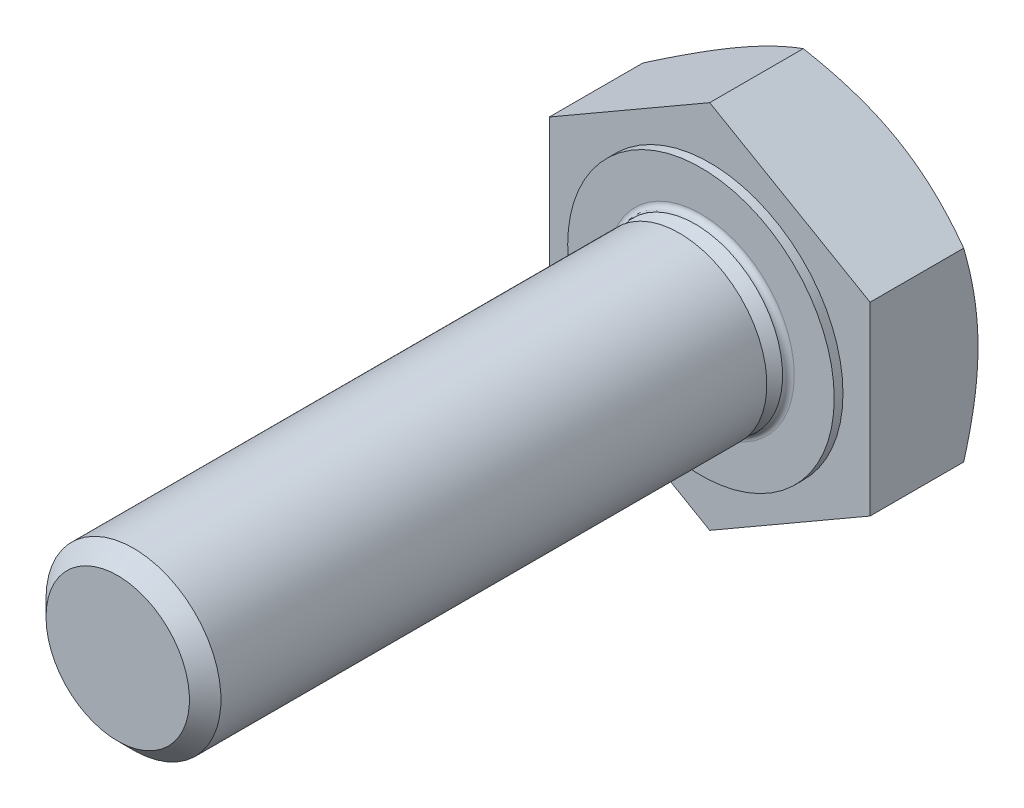
ISO-10303-21;
HEADER;
FILE_DESCRIPTION(('STEP AP214'),'2;1');
FILE_NAME('part.step','',(''),(''),'','','');
FILE_SCHEMA(('AUTOMOTIVE_DESIGN { 1 0 10303 214 1 1 1 1 }'));
ENDSEC;
DATA;
#1=APPLICATION_CONTEXT('core data for automotive mechanical design processes');
#2=APPLICATION_PROTOCOL_DEFINITION('international standard','automotive_design',2000,#1);
#3=PRODUCT_CONTEXT('',#1,'mechanical');
#4=PRODUCT('Part','Part','',(#3));
#5=PRODUCT_RELATED_PRODUCT_CATEGORY('part','',(#4));
#6=PRODUCT_DEFINITION_FORMATION('','',#4);
#7=PRODUCT_DEFINITION_CONTEXT('part definition',#1,'design');
#8=PRODUCT_DEFINITION('design','',#6,#7);
#9=PRODUCT_DEFINITION_SHAPE('','',#8);
#10=(LENGTH_UNIT() NAMED_UNIT(*) SI_UNIT(.MILLI.,.METRE.));
#11=(NAMED_UNIT(*) PLANE_ANGLE_UNIT() SI_UNIT($,.RADIAN.));
#12=(NAMED_UNIT(*) SI_UNIT($,.STERADIAN.) SOLID_ANGLE_UNIT());
#13=UNCERTAINTY_MEASURE_WITH_UNIT(LENGTH_MEASURE(1.E-05),#10,'distance_accuracy_value','');
#14=(GEOMETRIC_REPRESENTATION_CONTEXT(3) GLOBAL_UNCERTAINTY_ASSIGNED_CONTEXT((#13)) GLOBAL_UNIT_ASSIGNED_CONTEXT((#10,
#11,#12)) REPRESENTATION_CONTEXT('',''));
#15=CARTESIAN_POINT('',(0.,0.,0.));
#16=DIRECTION('',(0.,0.,1.));
#17=DIRECTION('',(1.,0.,0.));
#18=AXIS2_PLACEMENT_3D('',#15,#16,#17);
#19=CARTESIAN_POINT('',(0.,0.,10.));
#20=DIRECTION('',(0.,0.,-1.));
#21=DIRECTION('',(-1.,0.,0.));
#22=AXIS2_PLACEMENT_3D('',#19,#20,#21);
#23=PLANE('',#22);
#24=CARTESIAN_POINT('',(0.,0.,10.));
#25=DIRECTION('',(0.,0.,-1.));
#26=DIRECTION('',(-1.,0.,0.));
#27=AXIS2_PLACEMENT_3D('',#24,#25,#26);
#28=CIRCLE('',#27,1.229375);
#29=CARTESIAN_POINT('',(-1.229375,0.,10.));
#30=VERTEX_POINT('',#29);
#31=EDGE_CURVE('E11',#30,#30,#28,.T.);
#32=ORIENTED_EDGE('',*,*,#31,.F.);
#33=EDGE_LOOP('',(#32));
#34=FACE_BOUND('',#33,.T.);
#35=ADVANCED_FACE('F16',(#34),#23,.F.);
#36=CARTESIAN_POINT('',(0.,0.,10.));
#37=DIRECTION('',(0.,0.,-1.));
#38=DIRECTION('',(-1.,0.,0.));
#39=AXIS2_PLACEMENT_3D('',#36,#37,#38);
#40=CONICAL_SURFACE('',#39,1.229375,0.785398163397445);
#41=CARTESIAN_POINT('',(0.,0.,9.729375));
#42=DIRECTION('',(0.,0.,-1.));
#43=DIRECTION('',(-1.,0.,0.));
#44=AXIS2_PLACEMENT_3D('',#41,#42,#43);
#45=CIRCLE('',#44,1.5);
#46=CARTESIAN_POINT('',(-1.5,0.,9.729375));
#47=VERTEX_POINT('',#46);
#48=EDGE_CURVE('E25',#47,#47,#45,.T.);
#49=ORIENTED_EDGE('',*,*,#48,.F.);
#50=EDGE_LOOP('',(#49));
#51=FACE_BOUND('',#50,.T.);
#52=ORIENTED_EDGE('',*,*,#31,.T.);
#53=EDGE_LOOP('',(#52));
#54=FACE_BOUND('',#53,.T.);
#55=ADVANCED_FACE('F208',(#51,#54),#40,.T.);
#56=CARTESIAN_POINT('',(0.,0.,-0.65));
#57=DIRECTION('',(0.,0.,-1.));
#58=DIRECTION('',(-1.,0.,0.));
#59=AXIS2_PLACEMENT_3D('',#56,#57,#58);
#60=CYLINDRICAL_SURFACE('',#59,1.5);
#61=CARTESIAN_POINT('',(0.,0.,0.370625));
#62=DIRECTION('',(0.,0.,-1.));
#63=DIRECTION('',(-1.,0.,0.));
#64=AXIS2_PLACEMENT_3D('',#61,#62,#63);
#65=CIRCLE('',#64,1.5);
#66=CARTESIAN_POINT('',(-1.5,0.,0.370625));
#67=VERTEX_POINT('',#66);
#68=EDGE_CURVE('E223',#67,#67,#65,.T.);
#69=ORIENTED_EDGE('',*,*,#68,.F.);
#70=EDGE_LOOP('',(#69));
#71=FACE_BOUND('',#70,.T.);
#72=ORIENTED_EDGE('',*,*,#48,.T.);
#73=EDGE_LOOP('',(#72));
#74=FACE_BOUND('',#73,.T.);
#75=ADVANCED_FACE('F205',(#71,#74),#60,.T.);
#76=CARTESIAN_POINT('',(0.,1.5,0.370625));
#77=DIRECTION('',(0.,0.,1.));
#78=DIRECTION('',(1.,0.,0.));
#79=AXIS2_PLACEMENT_3D('',#76,#77,#78);
#80=PLANE('',#79);
#81=CARTESIAN_POINT('',(0.,0.,0.370625));
#82=DIRECTION('',(0.,0.,-1.));
#83=DIRECTION('',(-1.,0.,0.));
#84=AXIS2_PLACEMENT_3D('',#81,#82,#83);
#85=CIRCLE('',#84,1.229375);
#86=CARTESIAN_POINT('',(-1.229375,0.,0.370625));
#87=VERTEX_POINT('',#86);
#88=EDGE_CURVE('E230',#87,#87,#85,.T.);
#89=ORIENTED_EDGE('',*,*,#88,.F.);
#90=EDGE_LOOP('',(#89));
#91=FACE_BOUND('',#90,.T.);
#92=ORIENTED_EDGE('',*,*,#68,.T.);
#93=EDGE_LOOP('',(#92));
#94=FACE_BOUND('',#93,.T.);
#95=ADVANCED_FACE('F201',(#91,#94),#80,.F.);
#96=CARTESIAN_POINT('',(0.,0.,0.370625));
#97=DIRECTION('',(0.,0.,-1.));
#98=DIRECTION('',(-1.,0.,0.));
#99=AXIS2_PLACEMENT_3D('',#96,#97,#98);
#100=CONICAL_SURFACE('',#99,1.229375,0.785398163397449);
#101=CARTESIAN_POINT('',(0.,0.,0.1));
#102=DIRECTION('',(0.,0.,-1.));
#103=DIRECTION('',(-1.,0.,0.));
#104=AXIS2_PLACEMENT_3D('',#101,#102,#103);
#105=CIRCLE('',#104,1.5);
#106=CARTESIAN_POINT('',(-1.5,0.,0.1));
#107=VERTEX_POINT('',#106);
#108=EDGE_CURVE('E236',#107,#107,#105,.T.);
#109=ORIENTED_EDGE('',*,*,#108,.F.);
#110=EDGE_LOOP('',(#109));
#111=FACE_BOUND('',#110,.T.);
#112=ORIENTED_EDGE('',*,*,#88,.T.);
#113=EDGE_LOOP('',(#112));
#114=FACE_BOUND('',#113,.T.);
#115=ADVANCED_FACE('F197',(#111,#114),#100,.T.);
#116=CARTESIAN_POINT('',(0.,0.,0.1));
#117=DIRECTION('',(0.,0.,-1.));
#118=DIRECTION('',(-1.,0.,0.));
#119=AXIS2_PLACEMENT_3D('',#116,#117,#118);
#120=TOROIDAL_SURFACE('',#119,1.6,0.1);
#121=ORIENTED_EDGE('',*,*,#108,.T.);
#122=EDGE_LOOP('',(#121));
#123=FACE_BOUND('',#122,.T.);
#124=CARTESIAN_POINT('',(0.,0.,0.));
#125=DIRECTION('',(0.,0.,-1.));
#126=DIRECTION('',(-1.,0.,0.));
#127=AXIS2_PLACEMENT_3D('',#124,#125,#126);
#128=CIRCLE('',#127,1.6);
#129=CARTESIAN_POINT('',(-1.6,0.,0.));
#130=VERTEX_POINT('',#129);
#131=EDGE_CURVE('E240',#130,#130,#128,.T.);
#132=ORIENTED_EDGE('',*,*,#131,.F.);
#133=EDGE_LOOP('',(#132));
#134=FACE_BOUND('',#133,.T.);
#135=ADVANCED_FACE('F193',(#123,#134),#120,.F.);
#136=CARTESIAN_POINT('',(0.,1.6,0.));
#137=DIRECTION('',(0.,0.,-1.));
#138=DIRECTION('',(-1.,0.,0.));
#139=AXIS2_PLACEMENT_3D('',#136,#137,#138);
#140=PLANE('',#139);
#141=CARTESIAN_POINT('',(0.,0.,0.));
#142=DIRECTION('',(0.,0.,-1.));
#143=DIRECTION('',(-1.,0.,0.));
#144=AXIS2_PLACEMENT_3D('',#141,#142,#143);
#145=CIRCLE('',#144,2.285);
#146=CARTESIAN_POINT('',(-2.285,0.,0.));
#147=VERTEX_POINT('',#146);
#148=EDGE_CURVE('E243',#147,#147,#145,.T.);
#149=ORIENTED_EDGE('',*,*,#148,.F.);
#150=EDGE_LOOP('',(#149));
#151=FACE_BOUND('',#150,.T.);
#152=ORIENTED_EDGE('',*,*,#131,.T.);
#153=EDGE_LOOP('',(#152));
#154=FACE_BOUND('',#153,.T.);
#155=ADVANCED_FACE('F189',(#151,#154),#140,.F.);
#156=CARTESIAN_POINT('',(0.,0.,-0.65));
#157=DIRECTION('',(0.,0.,-1.));
#158=DIRECTION('',(-1.,0.,0.));
#159=AXIS2_PLACEMENT_3D('',#156,#157,#158);
#160=CYLINDRICAL_SURFACE('',#159,2.285);
#161=CARTESIAN_POINT('',(0.,0.,-0.15));
#162=DIRECTION('',(0.,0.,1.));
#163=DIRECTION('',(1.,0.,0.));
#164=AXIS2_PLACEMENT_3D('',#161,#162,#163);
#165=CIRCLE('',#164,2.285);
#166=CARTESIAN_POINT('',(2.285,0.,-0.15));
#167=VERTEX_POINT('',#166);
#168=EDGE_CURVE('E19',#167,#167,#165,.T.);
#169=ORIENTED_EDGE('',*,*,#168,.T.);
#170=EDGE_LOOP('',(#169));
#171=FACE_BOUND('',#170,.T.);
#172=ORIENTED_EDGE('',*,*,#148,.T.);
#173=EDGE_LOOP('',(#172));
#174=FACE_BOUND('',#173,.T.);
#175=ADVANCED_FACE('F186',(#171,#174),#160,.T.);
#176=CARTESIAN_POINT('',(0.,0.,-0.15));
#177=DIRECTION('',(0.,0.,1.));
#178=DIRECTION('',(-1.,0.,0.));
#179=AXIS2_PLACEMENT_3D('',#176,#177,#178);
#180=PLANE('',#179);
#181=DIRECTION('',(0.866025403784439,-0.5,0.));
#182=VECTOR('',#181,1.);
#183=CARTESIAN_POINT('',(0.,-3.17542648054294,-0.15));
#184=LINE('',#183,#182);
#185=CARTESIAN_POINT('',(-2.75,-1.58771324027147,-0.15));
#186=VERTEX_POINT('',#185);
#187=CARTESIAN_POINT('',(0.,-3.17542648054294,-0.15));
#188=VERTEX_POINT('',#187);
#189=EDGE_CURVE('E267',#186,#188,#184,.T.);
#190=ORIENTED_EDGE('',*,*,#189,.T.);
#191=DIRECTION('',(0.866025403784438,0.5,0.));
#192=VECTOR('',#191,1.);
#193=CARTESIAN_POINT('',(2.75,-1.58771324027147,-0.15));
#194=LINE('',#193,#192);
#195=CARTESIAN_POINT('',(2.75,-1.58771324027147,-0.15));
#196=VERTEX_POINT('',#195);
#197=EDGE_CURVE('E100',#188,#196,#194,.T.);
#198=ORIENTED_EDGE('',*,*,#197,.T.);
#199=DIRECTION('',(0.,1.,0.));
#200=VECTOR('',#199,1.);
#201=CARTESIAN_POINT('',(2.75,1.58771324027147,-0.15));
#202=LINE('',#201,#200);
#203=CARTESIAN_POINT('',(2.75,1.58771324027147,-0.15));
#204=VERTEX_POINT('',#203);
#205=EDGE_CURVE('E96',#196,#204,#202,.T.);
#206=ORIENTED_EDGE('',*,*,#205,.T.);
#207=DIRECTION('',(-0.866025403784439,0.5,0.));
#208=VECTOR('',#207,1.);
#209=CARTESIAN_POINT('',(0.,3.17542648054294,-0.15));
#210=LINE('',#209,#208);
#211=CARTESIAN_POINT('',(0.,3.17542648054294,-0.15));
#212=VERTEX_POINT('',#211);
#213=EDGE_CURVE('E108',#204,#212,#210,.T.);
#214=ORIENTED_EDGE('',*,*,#213,.T.);
#215=DIRECTION('',(-0.866025403784439,-0.5,0.));
#216=VECTOR('',#215,1.);
#217=CARTESIAN_POINT('',(-2.75,1.58771324027147,-0.15));
#218=LINE('',#217,#216);
#219=CARTESIAN_POINT('',(-2.75,1.58771324027147,-0.15));
#220=VERTEX_POINT('',#219);
#221=EDGE_CURVE('E292',#212,#220,#218,.T.);
#222=ORIENTED_EDGE('',*,*,#221,.T.);
#223=DIRECTION('',(0.,-1.,0.));
#224=VECTOR('',#223,1.);
#225=CARTESIAN_POINT('',(-2.75,-1.58771324027147,-0.15));
#226=LINE('',#225,#224);
#227=EDGE_CURVE('E271',#220,#186,#226,.T.);
#228=ORIENTED_EDGE('',*,*,#227,.T.);
#229=EDGE_LOOP('',(#190,#198,#206,#214,#222,#228));
#230=FACE_BOUND('',#229,.T.);
#231=ORIENTED_EDGE('',*,*,#168,.F.);
#232=EDGE_LOOP('',(#231));
#233=FACE_BOUND('',#232,.T.);
#234=ADVANCED_FACE('F141',(#230,#233),#180,.T.);
#235=CARTESIAN_POINT('',(0.,0.,-1.75390444775793));
#236=DIRECTION('',(0.,0.,1.));
#237=DIRECTION('',(-1.,0.,0.));
#238=AXIS2_PLACEMENT_3D('',#235,#236,#237);
#239=CONICAL_SURFACE('',#238,3.17625,1.0471975511966);
#240=CARTESIAN_POINT('',(0.,0.,-2.));
#241=DIRECTION('',(0.,0.,1.));
#242=DIRECTION('',(-1.,0.,0.));
#243=AXIS2_PLACEMENT_3D('',#240,#241,#242);
#244=CIRCLE('',#243,2.75);
#245=CARTESIAN_POINT('',(-1.375,-2.38156986040721,-2.));
#246=VERTEX_POINT('',#245);
#247=CARTESIAN_POINT('',(1.375,-2.38156986040721,-2.));
#248=VERTEX_POINT('',#247);
#249=EDGE_CURVE('E314',#246,#248,#244,.T.);
#250=ORIENTED_EDGE('',*,*,#249,.T.);
#251=CARTESIAN_POINT('',(2.750002,-1.58771208557093,-1.75437924027111));
#252=CARTESIAN_POINT('',(2.62915612085022,-1.65748248642851,-1.79467292047909));
#253=CARTESIAN_POINT('',(2.50726710186514,-1.72785514435081,-1.83131792217716));
#254=CARTESIAN_POINT('',(2.26137863431359,-1.86981891728232,-1.89528069122831));
#255=CARTESIAN_POINT('',(2.13737481818672,-1.94141255390371,-1.92257583341488));
#256=CARTESIAN_POINT('',(1.89090390407776,-2.08371260251193,-1.96506271633853));
#257=CARTESIAN_POINT('',(1.76847471831933,-2.15439712586623,-1.98053726335408));
#258=CARTESIAN_POINT('',(1.52304057361299,-2.29609859538076,-1.99900723381397));
#259=CARTESIAN_POINT('',(1.40003650614739,-2.36711502684345,-2.00201795561212));
#260=CARTESIAN_POINT('',(1.17021633803182,-2.49980176277017,-1.99573883896288));
#261=CARTESIAN_POINT('',(1.06336575208685,-2.56149197732857,-1.9879907318379));
#262=CARTESIAN_POINT('',(0.850360677359033,-2.68447051456143,-1.96343868045749));
#263=CARTESIAN_POINT('',(0.744206924761406,-2.74575841219916,-1.94662635736892));
#264=CARTESIAN_POINT('',(0.530763034689776,-2.8689902995889,-1.90459877801697));
#265=CARTESIAN_POINT('',(0.423499897978887,-2.93091870044305,-1.87920545160062));
#266=CARTESIAN_POINT('',(0.210572997292227,-3.05385210387221,-1.82157332618879));
#267=CARTESIAN_POINT('',(0.104906507552426,-3.11485868016781,-1.78934805987542));
#268=CARTESIAN_POINT('',(-1.99999999931377E-06,-3.17542763524348,-1.75437924027111));
#269=B_SPLINE_CURVE_WITH_KNOTS('',3,(#251,#252,#253,#254,#255,#256,#257,#258,#259,#260,#261,
#262,#263,#264,#265,#266,#267,#268),.UNSPECIFIED.,.F.,.F.,(4,2,2,2,2,2,2,2,4),(0.,
0.435897174011014,0.872841818983068,1.29897342204202,1.72458182710171,2.0950998279895,
2.46596091919292,2.84504596377344,3.22338701890322),.UNSPECIFIED.);
#270=CARTESIAN_POINT('',(0.,-3.17542648054294,-1.75437990693814));
#271=VERTEX_POINT('',#270);
#272=EDGE_CURVE('E32',#248,#271,#269,.T.);
#273=ORIENTED_EDGE('',*,*,#272,.T.);
#274=CARTESIAN_POINT('',(2.00000000032905E-06,-3.17542763524348,-1.75437924027111));
#275=CARTESIAN_POINT('',(-0.120843879149776,-3.1056572343859,-1.79467292047909));
#276=CARTESIAN_POINT('',(-0.242732898134861,-3.0352845764636,-1.83131792217716));
#277=CARTESIAN_POINT('',(-0.488621365686414,-2.89332080353209,-1.89528069122831));
#278=CARTESIAN_POINT('',(-0.612625181813276,-2.8217271669107,-1.92257583341489));
#279=CARTESIAN_POINT('',(-0.859096095922239,-2.67942711830248,-1.96506271633853));
#280=CARTESIAN_POINT('',(-0.98152528168067,-2.60874259494818,-1.98053726335408));
#281=CARTESIAN_POINT('',(-1.22695942638702,-2.46704112543365,-1.99900723381397));
#282=CARTESIAN_POINT('',(-1.34996349385262,-2.39602469397096,-2.00201795561212));
#283=CARTESIAN_POINT('',(-1.57978366196818,-2.26333795804424,-1.99573883896288));
#284=CARTESIAN_POINT('',(-1.68663424791315,-2.20164774348584,-1.9879907318379));
#285=CARTESIAN_POINT('',(-1.89963932264097,-2.07866920625298,-1.96343868045749));
#286=CARTESIAN_POINT('',(-2.0057930752386,-2.01738130861525,-1.94662635736892));
#287=CARTESIAN_POINT('',(-2.21923696531022,-1.89414942122551,-1.90459877801697));
#288=CARTESIAN_POINT('',(-2.32650010202111,-1.83222102037136,-1.87920545160062));
#289=CARTESIAN_POINT('',(-2.53942700270777,-1.7092876169422,-1.82157332618879));
#290=CARTESIAN_POINT('',(-2.64509349244757,-1.64828104064661,-1.78934805987542));
#291=CARTESIAN_POINT('',(-2.750002,-1.58771208557094,-1.75437924027111));
#292=B_SPLINE_CURVE_WITH_KNOTS('',3,(#274,#275,#276,#277,#278,#279,#280,#281,#282,#283,#284,
#285,#286,#287,#288,#289,#290,#291),.UNSPECIFIED.,.F.,.F.,(4,2,2,2,2,2,2,2,4),(0.,
0.435897174011015,0.87284181898307,1.29897342204202,1.72458182710171,2.0950998279895,
2.46596091919292,2.84504596377344,3.22338701890322),.UNSPECIFIED.);
#293=EDGE_CURVE('E171',#271,#246,#292,.T.);
#294=ORIENTED_EDGE('',*,*,#293,.T.);
#295=EDGE_LOOP('',(#250,#273,#294));
#296=FACE_BOUND('',#295,.T.);
#297=ADVANCED_FACE('F139',(#296),#239,.T.);
#298=CARTESIAN_POINT('',(2.75,0.,-2.));
#299=VERTEX_POINT('',#298);
#300=CARTESIAN_POINT('',(1.375,2.38156986040721,-2.));
#301=VERTEX_POINT('',#300);
#302=EDGE_CURVE('E332',#299,#301,#244,.T.);
#303=ORIENTED_EDGE('',*,*,#302,.T.);
#304=CARTESIAN_POINT('',(-2.00000000052029E-06,3.17542763524348,-1.7543792402711));
#305=CARTESIAN_POINT('',(0.120843879149775,3.1056572343859,-1.79467292047909));
#306=CARTESIAN_POINT('',(0.242732898134861,3.0352845764636,-1.83131792217716));
#307=CARTESIAN_POINT('',(0.488621365686414,2.89332080353209,-1.89528069122831));
#308=CARTESIAN_POINT('',(0.612625181813275,2.8217271669107,-1.92257583341489));
#309=CARTESIAN_POINT('',(0.859096095922239,2.67942711830248,-1.96506271633853));
#310=CARTESIAN_POINT('',(0.98152528168067,2.60874259494818,-1.98053726335408));
#311=CARTESIAN_POINT('',(1.22695942638702,2.46704112543365,-1.99900723381397));
#312=CARTESIAN_POINT('',(1.34996349385262,2.39602469397096,-2.00201795561212));
#313=CARTESIAN_POINT('',(1.57978366196818,2.26333795804424,-1.99573883896288));
#314=CARTESIAN_POINT('',(1.68663424791315,2.20164774348584,-1.9879907318379));
#315=CARTESIAN_POINT('',(1.89963932264097,2.07866920625298,-1.96343868045749));
#316=CARTESIAN_POINT('',(2.0057930752386,2.01738130861525,-1.94662635736892));
#317=CARTESIAN_POINT('',(2.21923696531022,1.89414942122551,-1.90459877801697));
#318=CARTESIAN_POINT('',(2.32650010202111,1.83222102037136,-1.87920545160062));
#319=CARTESIAN_POINT('',(2.53942700270777,1.7092876169422,-1.82157332618879));
#320=CARTESIAN_POINT('',(2.64509349244757,1.64828104064661,-1.78934805987542));
#321=CARTESIAN_POINT('',(2.750002,1.58771208557094,-1.75437924027111));
#322=B_SPLINE_CURVE_WITH_KNOTS('',3,(#304,#305,#306,#307,#308,#309,#310,#311,#312,#313,#314,
#315,#316,#317,#318,#319,#320,#321),.UNSPECIFIED.,.F.,.F.,(4,2,2,2,2,2,2,2,4),(0.,
0.435897174011015,0.872841818983071,1.29897342204202,1.72458182710172,2.0950998279895,
2.46596091919292,2.84504596377344,3.22338701890322),.UNSPECIFIED.);
#323=CARTESIAN_POINT('',(2.75,1.58771324027147,-1.75437990693814));
#324=VERTEX_POINT('',#323);
#325=EDGE_CURVE('E147',#301,#324,#322,.T.);
#326=ORIENTED_EDGE('',*,*,#325,.T.);
#327=CARTESIAN_POINT('',(2.75,4.21091544038396,-0.684019681711729));
#328=CARTESIAN_POINT('',(2.75,4.09017437588851,-0.742368707183688));
#329=CARTESIAN_POINT('',(2.75,3.96914784711614,-0.800137715262762));
#330=CARTESIAN_POINT('',(2.75,3.72636951096205,-0.91418425621132));
#331=CARTESIAN_POINT('',(2.75,3.6046175824246,-0.97046153086399));
#332=CARTESIAN_POINT('',(2.75,3.35957643515293,-1.08148962191275));
#333=CARTESIAN_POINT('',(2.75,3.23628240631407,-1.13622986065184));
#334=CARTESIAN_POINT('',(2.75,2.98868100437406,-1.24335920729038));
#335=CARTESIAN_POINT('',(2.75,2.86437368449152,-1.29574843773788));
#336=CARTESIAN_POINT('',(2.75,2.61300450954009,-1.39817269250286));
#337=CARTESIAN_POINT('',(2.75,2.48592757393808,-1.44817090922629));
#338=CARTESIAN_POINT('',(2.75,2.23027484276222,-1.54425165729229));
#339=CARTESIAN_POINT('',(2.75,2.10169888223727,-1.59033375299501));
#340=CARTESIAN_POINT('',(2.75,1.84310760285608,-1.67734409392986));
#341=CARTESIAN_POINT('',(2.75,1.71309600867851,-1.71828329565219));
#342=CARTESIAN_POINT('',(2.75,1.45122453211976,-1.79367831866066));
#343=CARTESIAN_POINT('',(2.75,1.3193652484388,-1.82813619015518));
#344=CARTESIAN_POINT('',(2.75,1.05370835973643,-1.8888957515256));
#345=CARTESIAN_POINT('',(2.75,0.919910249320777,-1.91519527322314));
#346=CARTESIAN_POINT('',(2.75,0.650700809036252,-1.95786745335482));
#347=CARTESIAN_POINT('',(2.75,0.515289477753012,-1.97424010308503));
#348=CARTESIAN_POINT('',(2.75,0.244419787628747,-1.99561013382522));
#349=CARTESIAN_POINT('',(2.75,0.108967258717275,-2.00067953612215));
#350=CARTESIAN_POINT('',(2.75,-0.161843059976616,-1.99917372347299));
#351=CARTESIAN_POINT('',(2.75,-0.297200865225811,-1.99260153157476));
#352=CARTESIAN_POINT('',(2.75,-0.528341855784543,-1.97190059644488));
#353=CARTESIAN_POINT('',(2.75,-0.624380039942034,-1.96046809753876));
#354=CARTESIAN_POINT('',(2.75,-0.815714586504112,-1.93248611681532));
#355=CARTESIAN_POINT('',(2.75,-0.911010829492239,-1.91593582805087));
#356=CARTESIAN_POINT('',(2.75,-1.19570893930552,-1.8594768667663));
#357=CARTESIAN_POINT('',(2.75,-1.38377638238591,-1.81277463442329));
#358=CARTESIAN_POINT('',(2.75,-1.66519083702709,-1.73222534427907));
#359=CARTESIAN_POINT('',(2.75,-1.76000470576513,-1.70321560843497));
#360=CARTESIAN_POINT('',(2.75,-1.94864284283357,-1.64232546778638));
#361=CARTESIAN_POINT('',(2.75,-2.0424677445283,-1.61044704292464));
#362=CARTESIAN_POINT('',(2.75,-2.22873560264422,-1.54448286971691));
#363=CARTESIAN_POINT('',(2.75,-2.32118336499496,-1.51041055539404));
#364=CARTESIAN_POINT('',(2.75,-2.5053616066891,-1.44026597621142));
#365=CARTESIAN_POINT('',(2.75,-2.59709177881638,-1.40419290309535));
#366=CARTESIAN_POINT('',(2.75,-2.68849026920457,-1.36731688469231));
#367=B_SPLINE_CURVE_WITH_KNOTS('',3,(#327,#328,#329,#330,#331,#332,#333,#334,#335,#336,#337,
#338,#339,#340,#341,#342,#343,#344,#345,#346,#347,#348,#349,#350,#351,#352,#353,#354,#355,#356,
#357,#358,#359,#360,#361,#362,#363,#364,#365,#366),.UNSPECIFIED.,.F.,.F.,(4,2,2,2,2,2,2,2,2,2,2,
2,2,2,2,2,2,2,2,4),(0.,0.402307675579641,0.80468454116917,1.20936393187761,1.61402220381253,
2.02364942710366,2.43332215894505,2.84210675846266,3.25076183082298,3.65952541526239,
4.06828935810731,4.47444123165121,4.88048765257976,5.17049481634027,5.46054773029393,
6.04108522031029,6.33851935652275,6.63574975827877,6.93130717624915,7.22698487417713),.UNSPECIFIED.);
#368=EDGE_CURVE('E113',#324,#299,#367,.T.);
#369=ORIENTED_EDGE('',*,*,#368,.T.);
#370=EDGE_LOOP('',(#303,#326,#369));
#371=FACE_BOUND('',#370,.T.);
#372=ADVANCED_FACE('F140',(#371),#239,.T.);
#373=CARTESIAN_POINT('',(-1.375,2.38156986040721,-2.));
#374=VERTEX_POINT('',#373);
#375=EDGE_CURVE('E336',#301,#374,#244,.T.);
#376=ORIENTED_EDGE('',*,*,#375,.T.);
#377=CARTESIAN_POINT('',(-2.750002,1.58771208557093,-1.75437924027111));
#378=CARTESIAN_POINT('',(-2.62915612085022,1.65748248642851,-1.79467292047909));
#379=CARTESIAN_POINT('',(-2.50726710186514,1.72785514435081,-1.83131792217716));
#380=CARTESIAN_POINT('',(-2.26137863431359,1.86981891728232,-1.89528069122831));
#381=CARTESIAN_POINT('',(-2.13737481818672,1.94141255390371,-1.92257583341488));
#382=CARTESIAN_POINT('',(-1.89090390407776,2.08371260251193,-1.96506271633853));
#383=CARTESIAN_POINT('',(-1.76847471831933,2.15439712586623,-1.98053726335408));
#384=CARTESIAN_POINT('',(-1.52304057361298,2.29609859538076,-1.99900723381397));
#385=CARTESIAN_POINT('',(-1.40003650614738,2.36711502684345,-2.00201795561212));
#386=CARTESIAN_POINT('',(-1.17021633803182,2.49980176277017,-1.99573883896288));
#387=CARTESIAN_POINT('',(-1.06336575208685,2.56149197732857,-1.9879907318379));
#388=CARTESIAN_POINT('',(-0.850360677359031,2.68447051456143,-1.96343868045749));
#389=CARTESIAN_POINT('',(-0.744206924761404,2.74575841219916,-1.94662635736892));
#390=CARTESIAN_POINT('',(-0.530763034689774,2.8689902995889,-1.90459877801697));
#391=CARTESIAN_POINT('',(-0.423499897978884,2.93091870044305,-1.87920545160062));
#392=CARTESIAN_POINT('',(-0.210572997292225,3.05385210387221,-1.82157332618879));
#393=CARTESIAN_POINT('',(-0.104906507552424,3.11485868016781,-1.78934805987542));
#394=CARTESIAN_POINT('',(2.00000000000356E-06,3.17542763524348,-1.7543792402711));
#395=B_SPLINE_CURVE_WITH_KNOTS('',3,(#377,#378,#379,#380,#381,#382,#383,#384,#385,#386,#387,
#388,#389,#390,#391,#392,#393,#394),.UNSPECIFIED.,.F.,.F.,(4,2,2,2,2,2,2,2,4),(0.,
0.435897174011014,0.872841818983069,1.29897342204202,1.72458182710171,2.0950998279895,
2.46596091919292,2.84504596377344,3.22338701890322),.UNSPECIFIED.);
#396=CARTESIAN_POINT('',(0.,3.17542648054294,-1.75437990693814));
#397=VERTEX_POINT('',#396);
#398=EDGE_CURVE('E154',#374,#397,#395,.T.);
#399=ORIENTED_EDGE('',*,*,#398,.T.);
#400=EDGE_CURVE('E339',#397,#301,#322,.T.);
#401=ORIENTED_EDGE('',*,*,#400,.T.);
#402=EDGE_LOOP('',(#376,#399,#401));
#403=FACE_BOUND('',#402,.T.);
#404=ADVANCED_FACE('F326',(#403),#239,.T.);
#405=CARTESIAN_POINT('',(-2.75,0.,-2.));
#406=VERTEX_POINT('',#405);
#407=EDGE_CURVE('E354',#374,#406,#244,.T.);
#408=ORIENTED_EDGE('',*,*,#407,.T.);
#409=CARTESIAN_POINT('',(-2.75,4.21091544038396,-0.684019681711729));
#410=CARTESIAN_POINT('',(-2.75,4.09017437588851,-0.742368707183687));
#411=CARTESIAN_POINT('',(-2.75,3.96914784711614,-0.800137715262761));
#412=CARTESIAN_POINT('',(-2.75,3.72636951096205,-0.914184256211319));
#413=CARTESIAN_POINT('',(-2.75,3.6046175824246,-0.97046153086399));
#414=CARTESIAN_POINT('',(-2.75,3.35957643515293,-1.08148962191275));
#415=CARTESIAN_POINT('',(-2.75,3.23628240631407,-1.13622986065184));
#416=CARTESIAN_POINT('',(-2.75,2.98868100437406,-1.24335920729038));
#417=CARTESIAN_POINT('',(-2.75,2.86437368449152,-1.29574843773788));
#418=CARTESIAN_POINT('',(-2.75,2.61300450954009,-1.39817269250286));
#419=CARTESIAN_POINT('',(-2.75,2.48592757393808,-1.44817090922628));
#420=CARTESIAN_POINT('',(-2.75,2.23027484276221,-1.54425165729229));
#421=CARTESIAN_POINT('',(-2.75,2.10169888223727,-1.59033375299501));
#422=CARTESIAN_POINT('',(-2.75,1.84310760285608,-1.67734409392986));
#423=CARTESIAN_POINT('',(-2.75,1.71309600867851,-1.71828329565219));
#424=CARTESIAN_POINT('',(-2.75,1.45122453211976,-1.79367831866066));
#425=CARTESIAN_POINT('',(-2.75,1.3193652484388,-1.82813619015518));
#426=CARTESIAN_POINT('',(-2.75,1.05370835973643,-1.8888957515256));
#427=CARTESIAN_POINT('',(-2.75,0.919910249320773,-1.91519527322314));
#428=CARTESIAN_POINT('',(-2.75,0.650700809036249,-1.95786745335482));
#429=CARTESIAN_POINT('',(-2.75,0.515289477753008,-1.97424010308503));
#430=CARTESIAN_POINT('',(-2.75,0.244419787628744,-1.99561013382522));
#431=CARTESIAN_POINT('',(-2.75,0.108967258717272,-2.00067953612215));
#432=CARTESIAN_POINT('',(-2.75,-0.161843059976619,-1.99917372347299));
#433=CARTESIAN_POINT('',(-2.75,-0.297200865225814,-1.99260153157476));
#434=CARTESIAN_POINT('',(-2.75,-0.528341855784545,-1.97190059644488));
#435=CARTESIAN_POINT('',(-2.75,-0.624380039942036,-1.96046809753876));
#436=CARTESIAN_POINT('',(-2.75,-0.815714586504113,-1.93248611681532));
#437=CARTESIAN_POINT('',(-2.75,-0.91101082949224,-1.91593582805088));
#438=CARTESIAN_POINT('',(-2.75,-1.19570893930552,-1.8594768667663));
#439=CARTESIAN_POINT('',(-2.75,-1.38377638238591,-1.81277463442329));
#440=CARTESIAN_POINT('',(-2.75,-1.66519083702709,-1.73222534427907));
#441=CARTESIAN_POINT('',(-2.75,-1.76000470576513,-1.70321560843497));
#442=CARTESIAN_POINT('',(-2.75,-1.94864284283357,-1.64232546778638));
#443=CARTESIAN_POINT('',(-2.75,-2.0424677445283,-1.61044704292464));
#444=CARTESIAN_POINT('',(-2.75,-2.22873560264422,-1.54448286971692));
#445=CARTESIAN_POINT('',(-2.75,-2.32118336499496,-1.51041055539404));
#446=CARTESIAN_POINT('',(-2.75,-2.5053616066891,-1.44026597621142));
#447=CARTESIAN_POINT('',(-2.75,-2.59709177881638,-1.40419290309535));
#448=CARTESIAN_POINT('',(-2.75,-2.68849026920457,-1.36731688469231));
#449=B_SPLINE_CURVE_WITH_KNOTS('',3,(#409,#410,#411,#412,#413,#414,#415,#416,#417,#418,#419,
#420,#421,#422,#423,#424,#425,#426,#427,#428,#429,#430,#431,#432,#433,#434,#435,#436,#437,#438,
#439,#440,#441,#442,#443,#444,#445,#446,#447,#448),.UNSPECIFIED.,.F.,.F.,(4,2,2,2,2,2,2,2,2,2,2,
2,2,2,2,2,2,2,2,4),(0.,0.402307675579641,0.80468454116917,1.20936393187761,1.61402220381253,
2.02364942710366,2.43332215894505,2.84210675846266,3.25076183082299,3.65952541526239,
4.06828935810731,4.47444123165121,4.88048765257976,5.17049481634027,5.46054773029393,
6.04108522031029,6.33851935652275,6.63574975827877,6.93130717624915,7.22698487417713),.UNSPECIFIED.);
#450=CARTESIAN_POINT('',(-2.75,1.58771324027147,-1.75437990693814));
#451=VERTEX_POINT('',#450);
#452=EDGE_CURVE('E160',#406,#451,#449,.F.);
#453=ORIENTED_EDGE('',*,*,#452,.T.);
#454=EDGE_CURVE('E358',#451,#374,#395,.T.);
#455=ORIENTED_EDGE('',*,*,#454,.T.);
#456=EDGE_LOOP('',(#408,#453,#455));
#457=FACE_BOUND('',#456,.T.);
#458=ADVANCED_FACE('F345',(#457),#239,.T.);
#459=EDGE_CURVE('E318',#406,#246,#244,.T.);
#460=ORIENTED_EDGE('',*,*,#459,.T.);
#461=CARTESIAN_POINT('',(-2.75,-1.58771324027147,-1.75437990693814));
#462=VERTEX_POINT('',#461);
#463=EDGE_CURVE('E40',#246,#462,#292,.T.);
#464=ORIENTED_EDGE('',*,*,#463,.T.);
#465=EDGE_CURVE('E172',#462,#406,#449,.F.);
#466=ORIENTED_EDGE('',*,*,#465,.T.);
#467=EDGE_LOOP('',(#460,#464,#466));
#468=FACE_BOUND('',#467,.T.);
#469=ADVANCED_FACE('F307',(#468),#239,.T.);
#470=CARTESIAN_POINT('',(0.,-2.75,-2.));
#471=DIRECTION('',(0.,0.,-1.));
#472=DIRECTION('',(1.,0.,0.));
#473=AXIS2_PLACEMENT_3D('',#470,#471,#472);
#474=PLANE('',#473);
#475=ORIENTED_EDGE('',*,*,#459,.F.);
#476=ORIENTED_EDGE('',*,*,#407,.F.);
#477=ORIENTED_EDGE('',*,*,#375,.F.);
#478=ORIENTED_EDGE('',*,*,#302,.F.);
#479=EDGE_CURVE('E111',#248,#299,#244,.T.);
#480=ORIENTED_EDGE('',*,*,#479,.F.);
#481=ORIENTED_EDGE('',*,*,#249,.F.);
#482=EDGE_LOOP('',(#475,#476,#477,#478,#480,#481));
#483=FACE_BOUND('',#482,.T.);
#484=ADVANCED_FACE('F138',(#483),#474,.T.);
#485=CARTESIAN_POINT('',(2.75,-1.58771324027147,-1.75437990693814));
#486=VERTEX_POINT('',#485);
#487=EDGE_CURVE('E93',#299,#486,#367,.T.);
#488=ORIENTED_EDGE('',*,*,#487,.T.);
#489=EDGE_CURVE('E102',#486,#248,#269,.T.);
#490=ORIENTED_EDGE('',*,*,#489,.T.);
#491=ORIENTED_EDGE('',*,*,#479,.T.);
#492=EDGE_LOOP('',(#488,#490,#491));
#493=FACE_BOUND('',#492,.T.);
#494=ADVANCED_FACE('F110',(#493),#239,.T.);
#495=CARTESIAN_POINT('',(2.75,-1.58771324027147,-3.));
#496=DIRECTION('',(-0.5,0.866025403784438,0.));
#497=DIRECTION('',(0.866025403784438,0.5,0.));
#498=AXIS2_PLACEMENT_3D('',#495,#496,#497);
#499=PLANE('',#498);
#500=ORIENTED_EDGE('',*,*,#197,.F.);
#501=DIRECTION('',(0.,0.,1.));
#502=VECTOR('',#501,1.);
#503=CARTESIAN_POINT('',(0.,-3.17542648054294,-3.));
#504=LINE('',#503,#502);
#505=EDGE_CURVE('E114',#271,#188,#504,.T.);
#506=ORIENTED_EDGE('',*,*,#505,.F.);
#507=ORIENTED_EDGE('',*,*,#272,.F.);
#508=ORIENTED_EDGE('',*,*,#489,.F.);
#509=DIRECTION('',(0.,0.,1.));
#510=VECTOR('',#509,1.);
#511=CARTESIAN_POINT('',(2.75,-1.58771324027147,-3.));
#512=LINE('',#511,#510);
#513=EDGE_CURVE('E90',#486,#196,#512,.T.);
#514=ORIENTED_EDGE('',*,*,#513,.T.);
#515=EDGE_LOOP('',(#500,#506,#507,#508,#514));
#516=FACE_BOUND('',#515,.T.);
#517=ADVANCED_FACE('F103',(#516),#499,.F.);
#518=CARTESIAN_POINT('',(0.,-3.17542648054294,-3.));
#519=DIRECTION('',(0.5,0.866025403784439,0.));
#520=DIRECTION('',(0.866025403784439,-0.5,0.));
#521=AXIS2_PLACEMENT_3D('',#518,#519,#520);
#522=PLANE('',#521);
#523=ORIENTED_EDGE('',*,*,#189,.F.);
#524=DIRECTION('',(0.,0.,1.));
#525=VECTOR('',#524,1.);
#526=CARTESIAN_POINT('',(-2.75,-1.58771324027147,-3.));
#527=LINE('',#526,#525);
#528=EDGE_CURVE('E122',#462,#186,#527,.T.);
#529=ORIENTED_EDGE('',*,*,#528,.F.);
#530=ORIENTED_EDGE('',*,*,#463,.F.);
#531=ORIENTED_EDGE('',*,*,#293,.F.);
#532=ORIENTED_EDGE('',*,*,#505,.T.);
#533=EDGE_LOOP('',(#523,#529,#530,#531,#532));
#534=FACE_BOUND('',#533,.T.);
#535=ADVANCED_FACE('F178',(#534),#522,.F.);
#536=CARTESIAN_POINT('',(-2.75,-1.58771324027147,-3.));
#537=DIRECTION('',(1.,0.,0.));
#538=DIRECTION('',(0.,-1.,0.));
#539=AXIS2_PLACEMENT_3D('',#536,#537,#538);
#540=PLANE('',#539);
#541=ORIENTED_EDGE('',*,*,#227,.F.);
#542=DIRECTION('',(0.,0.,1.));
#543=VECTOR('',#542,1.);
#544=CARTESIAN_POINT('',(-2.75,1.58771324027147,-3.));
#545=LINE('',#544,#543);
#546=EDGE_CURVE('E281',#451,#220,#545,.T.);
#547=ORIENTED_EDGE('',*,*,#546,.F.);
#548=ORIENTED_EDGE('',*,*,#452,.F.);
#549=ORIENTED_EDGE('',*,*,#465,.F.);
#550=ORIENTED_EDGE('',*,*,#528,.T.);
#551=EDGE_LOOP('',(#541,#547,#548,#549,#550));
#552=FACE_BOUND('',#551,.T.);
#553=ADVANCED_FACE('F181',(#552),#540,.F.);
#554=CARTESIAN_POINT('',(-2.75,1.58771324027147,-3.));
#555=DIRECTION('',(0.5,-0.866025403784439,0.));
#556=DIRECTION('',(-0.866025403784439,-0.5,0.));
#557=AXIS2_PLACEMENT_3D('',#554,#555,#556);
#558=PLANE('',#557);
#559=ORIENTED_EDGE('',*,*,#221,.F.);
#560=DIRECTION('',(0.,0.,1.));
#561=VECTOR('',#560,1.);
#562=CARTESIAN_POINT('',(0.,3.17542648054294,-3.));
#563=LINE('',#562,#561);
#564=EDGE_CURVE('E277',#397,#212,#563,.T.);
#565=ORIENTED_EDGE('',*,*,#564,.F.);
#566=ORIENTED_EDGE('',*,*,#398,.F.);
#567=ORIENTED_EDGE('',*,*,#454,.F.);
#568=ORIENTED_EDGE('',*,*,#546,.T.);
#569=EDGE_LOOP('',(#559,#565,#566,#567,#568));
#570=FACE_BOUND('',#569,.T.);
#571=ADVANCED_FACE('F429',(#570),#558,.F.);
#572=CARTESIAN_POINT('',(0.,3.17542648054294,-3.));
#573=DIRECTION('',(-0.5,-0.866025403784439,0.));
#574=DIRECTION('',(-0.866025403784439,0.5,0.));
#575=AXIS2_PLACEMENT_3D('',#572,#573,#574);
#576=PLANE('',#575);
#577=ORIENTED_EDGE('',*,*,#213,.F.);
#578=DIRECTION('',(0.,0.,1.));
#579=VECTOR('',#578,1.);
#580=CARTESIAN_POINT('',(2.75,1.58771324027147,-3.));
#581=LINE('',#580,#579);
#582=EDGE_CURVE('E99',#324,#204,#581,.T.);
#583=ORIENTED_EDGE('',*,*,#582,.F.);
#584=ORIENTED_EDGE('',*,*,#325,.F.);
#585=ORIENTED_EDGE('',*,*,#400,.F.);
#586=ORIENTED_EDGE('',*,*,#564,.T.);
#587=EDGE_LOOP('',(#577,#583,#584,#585,#586));
#588=FACE_BOUND('',#587,.T.);
#589=ADVANCED_FACE('F438',(#588),#576,.F.);
#590=CARTESIAN_POINT('',(2.75,1.58771324027147,-3.));
#591=DIRECTION('',(-1.,0.,0.));
#592=DIRECTION('',(0.,1.,0.));
#593=AXIS2_PLACEMENT_3D('',#590,#591,#592);
#594=PLANE('',#593);
#595=ORIENTED_EDGE('',*,*,#205,.F.);
#596=ORIENTED_EDGE('',*,*,#513,.F.);
#597=ORIENTED_EDGE('',*,*,#487,.F.);
#598=ORIENTED_EDGE('',*,*,#368,.F.);
#599=ORIENTED_EDGE('',*,*,#582,.T.);
#600=EDGE_LOOP('',(#595,#596,#597,#598,#599));
#601=FACE_BOUND('',#600,.T.);
#602=ADVANCED_FACE('F91',(#601),#594,.F.);
#603=CLOSED_SHELL('',(#35,#55,#75,#95,#115,#135,#155,#175,#234,#297,#372,#404,#458,#469,#484,
#494,#517,#535,#553,#571,#589,#602));
#604=MANIFOLD_SOLID_BREP('B1',#603);
#605=ADVANCED_BREP_SHAPE_REPRESENTATION('',(#18,#604),#14);
#606=SHAPE_DEFINITION_REPRESENTATION(#9,#605);
ENDSEC;
END-ISO-10303-21;
